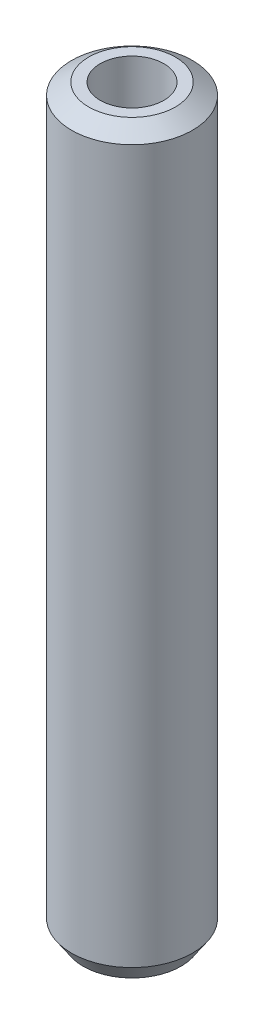
ISO-10303-21;
HEADER;
FILE_DESCRIPTION(('STEP AP214'),'2;1');
FILE_NAME('part.step','',(''),(''),'','','');
FILE_SCHEMA(('AUTOMOTIVE_DESIGN { 1 0 10303 214 1 1 1 1 }'));
ENDSEC;
DATA;
#1=APPLICATION_CONTEXT('core data for automotive mechanical design processes');
#2=APPLICATION_PROTOCOL_DEFINITION('international standard','automotive_design',2000,#1);
#3=PRODUCT_CONTEXT('',#1,'mechanical');
#4=PRODUCT('Part','Part','',(#3));
#5=PRODUCT_RELATED_PRODUCT_CATEGORY('part','',(#4));
#6=PRODUCT_DEFINITION_FORMATION('','',#4);
#7=PRODUCT_DEFINITION_CONTEXT('part definition',#1,'design');
#8=PRODUCT_DEFINITION('design','',#6,#7);
#9=PRODUCT_DEFINITION_SHAPE('','',#8);
#10=(LENGTH_UNIT() NAMED_UNIT(*) SI_UNIT(.MILLI.,.METRE.));
#11=(NAMED_UNIT(*) PLANE_ANGLE_UNIT() SI_UNIT($,.RADIAN.));
#12=(NAMED_UNIT(*) SI_UNIT($,.STERADIAN.) SOLID_ANGLE_UNIT());
#13=UNCERTAINTY_MEASURE_WITH_UNIT(LENGTH_MEASURE(1.E-05),#10,'distance_accuracy_value','');
#14=(GEOMETRIC_REPRESENTATION_CONTEXT(3) GLOBAL_UNCERTAINTY_ASSIGNED_CONTEXT((#13)) GLOBAL_UNIT_ASSIGNED_CONTEXT((#10,
#11,#12)) REPRESENTATION_CONTEXT('',''));
#15=CARTESIAN_POINT('',(0.,0.,0.));
#16=DIRECTION('',(0.,0.,1.));
#17=DIRECTION('',(1.,0.,0.));
#18=AXIS2_PLACEMENT_3D('',#15,#16,#17);
#19=CARTESIAN_POINT('',(0.,245.064112155446,0.));
#20=DIRECTION('',(0.,-1.,0.));
#21=DIRECTION('',(0.,0.,-1.));
#22=AXIS2_PLACEMENT_3D('',#19,#20,#21);
#23=CYLINDRICAL_SURFACE('',#22,20.);
#24=CARTESIAN_POINT('',(0.,241.248628773534,0.));
#25=DIRECTION('',(0.,1.,0.));
#26=DIRECTION('',(0.,0.,1.));
#27=AXIS2_PLACEMENT_3D('',#24,#25,#26);
#28=CIRCLE('',#27,20.);
#29=CARTESIAN_POINT('',(0.,241.248628773534,-20.));
#30=VERTEX_POINT('',#29);
#31=EDGE_CURVE('E50',#30,#30,#28,.F.);
#32=CARTESIAN_POINT('',(0.,5.68350444593166,0.));
#33=DIRECTION('',(0.,1.,0.));
#34=DIRECTION('',(0.,0.,1.));
#35=AXIS2_PLACEMENT_3D('',#32,#33,#34);
#36=CIRCLE('',#35,20.);
#37=CARTESIAN_POINT('',(0.,5.68350444593163,-20.));
#38=VERTEX_POINT('',#37);
#39=EDGE_CURVE('E51',#38,#38,#36,.T.);
#40=CARTESIAN_POINT('',(0.,241.248628773534,-20.));
#41=CARTESIAN_POINT('',(0.,238.794825395121,-20.));
#42=CARTESIAN_POINT('',(0.,236.341022016709,-20.));
#43=CARTESIAN_POINT('',(0.,231.433415259884,-20.));
#44=CARTESIAN_POINT('',(0.,228.979611881471,-20.));
#45=CARTESIAN_POINT('',(0.,224.072005124646,-20.));
#46=CARTESIAN_POINT('',(0.,221.618201746234,-20.));
#47=CARTESIAN_POINT('',(0.,216.710594989409,-20.));
#48=CARTESIAN_POINT('',(0.,214.256791610996,-20.));
#49=CARTESIAN_POINT('',(0.,209.349184854171,-20.));
#50=CARTESIAN_POINT('',(0.,206.895381475758,-20.));
#51=CARTESIAN_POINT('',(0.,201.987774718933,-20.));
#52=CARTESIAN_POINT('',(0.,199.533971340521,-20.));
#53=CARTESIAN_POINT('',(0.,194.626364583696,-20.));
#54=CARTESIAN_POINT('',(0.,192.172561205283,-20.));
#55=CARTESIAN_POINT('',(0.,187.264954448458,-20.));
#56=CARTESIAN_POINT('',(0.,184.811151070046,-20.));
#57=CARTESIAN_POINT('',(0.,179.903544313221,-20.));
#58=CARTESIAN_POINT('',(0.,177.449740934808,-20.));
#59=CARTESIAN_POINT('',(0.,172.542134177983,-20.));
#60=CARTESIAN_POINT('',(0.,170.088330799571,-20.));
#61=CARTESIAN_POINT('',(0.,165.180724042746,-20.));
#62=CARTESIAN_POINT('',(0.,162.726920664333,-20.));
#63=CARTESIAN_POINT('',(0.,157.819313907508,-20.));
#64=CARTESIAN_POINT('',(0.,155.365510529096,-20.));
#65=CARTESIAN_POINT('',(0.,150.45790377227,-20.));
#66=CARTESIAN_POINT('',(0.,148.004100393858,-20.));
#67=CARTESIAN_POINT('',(0.,143.096493637033,-20.));
#68=CARTESIAN_POINT('',(0.,140.64269025862,-20.));
#69=CARTESIAN_POINT('',(0.,135.735083501795,-20.));
#70=CARTESIAN_POINT('',(0.,133.281280123383,-20.));
#71=CARTESIAN_POINT('',(0.,128.373673366558,-20.));
#72=CARTESIAN_POINT('',(0.,125.919869988145,-20.));
#73=CARTESIAN_POINT('',(0.,121.01226323132,-20.));
#74=CARTESIAN_POINT('',(0.,118.558459852908,-20.));
#75=CARTESIAN_POINT('',(0.,113.650853096083,-20.));
#76=CARTESIAN_POINT('',(0.,111.19704971767,-20.));
#77=CARTESIAN_POINT('',(0.,106.289442960845,-20.));
#78=CARTESIAN_POINT('',(0.,103.835639582433,-20.));
#79=CARTESIAN_POINT('',(0.,98.9280328256075,-20.));
#80=CARTESIAN_POINT('',(0.,96.474229447195,-20.));
#81=CARTESIAN_POINT('',(0.,91.5666226903699,-20.));
#82=CARTESIAN_POINT('',(0.,89.1128193119574,-20.));
#83=CARTESIAN_POINT('',(0.,84.2052125551323,-20.));
#84=CARTESIAN_POINT('',(0.,81.7514091767198,-20.));
#85=CARTESIAN_POINT('',(0.,76.8438024198948,-20.));
#86=CARTESIAN_POINT('',(0.,74.3899990414823,-20.));
#87=CARTESIAN_POINT('',(0.,69.4823922846572,-20.));
#88=CARTESIAN_POINT('',(0.,67.0285889062447,-20.));
#89=CARTESIAN_POINT('',(0.,62.1209821494197,-20.));
#90=CARTESIAN_POINT('',(0.,59.6671787710071,-20.));
#91=CARTESIAN_POINT('',(0.,54.7595720141821,-20.));
#92=CARTESIAN_POINT('',(0.,52.3057686357695,-20.));
#93=CARTESIAN_POINT('',(0.,47.3981618789445,-20.));
#94=CARTESIAN_POINT('',(0.,44.944358500532,-20.));
#95=CARTESIAN_POINT('',(0.,40.0367517437069,-20.));
#96=CARTESIAN_POINT('',(0.,37.5829483652944,-20.));
#97=CARTESIAN_POINT('',(0.,32.6753416084694,-20.));
#98=CARTESIAN_POINT('',(0.,30.2215382300568,-20.));
#99=CARTESIAN_POINT('',(0.,25.3139314732318,-20.));
#100=CARTESIAN_POINT('',(0.,22.8601280948193,-20.));
#101=CARTESIAN_POINT('',(0.,17.9525213379942,-20.));
#102=CARTESIAN_POINT('',(0.,15.4987179595817,-20.));
#103=CARTESIAN_POINT('',(0.,10.5911112027567,-20.));
#104=CARTESIAN_POINT('',(0.,8.13730782434415,-20.));
#105=CARTESIAN_POINT('',(0.,5.68350444593163,-20.));
#106=B_SPLINE_CURVE_WITH_KNOTS('',3,(#40,#41,#42,#43,#44,#45,#46,#47,#48,#49,#50,#51,#52,#53,
#54,#55,#56,#57,#58,#59,#60,#61,#62,#63,#64,#65,#66,#67,#68,#69,#70,#71,#72,#73,#74,#75,#76,#77,
#78,#79,#80,#81,#82,#83,#84,#85,#86,#87,#88,#89,#90,#91,#92,#93,#94,#95,#96,#97,#98,#99,#100,
#101,#102,#103,#104,#105),.UNSPECIFIED.,.F.,.F.,(4,2,2,2,2,2,2,2,2,2,2,2,2,2,2,2,2,2,2,2,2,2,2,
2,2,2,2,2,2,2,2,2,4),(0.,7.36141013523758,14.7228202704751,22.0842304057127,29.4456405409503,
36.8070506761879,44.1684608114254,51.529870946663,58.8912810819005,66.2526912171381,
73.6141013523757,80.9755114876133,88.3369216228508,95.6983317580884,103.059741893326,
110.421152028564,117.782562163801,125.143972299039,132.505382434276,139.866792569514,
147.228202704751,154.589612839989,161.951022975226,169.312433110464,176.673843245702,
184.035253380939,191.396663516177,198.758073651414,206.119483786652,213.480893921889,
220.842304057127,228.203714192365,235.565124327602),.UNSPECIFIED.);
#107=EDGE_CURVE('BSEAM39',#30,#38,#106,.T.);
#108=ORIENTED_EDGE('',*,*,#31,.T.);
#109=ORIENTED_EDGE('',*,*,#39,.T.);
#110=ORIENTED_EDGE('',*,*,#107,.T.);
#111=ORIENTED_EDGE('',*,*,#107,.F.);
#112=EDGE_LOOP('',(#108,#110,#109,#111));
#113=FACE_BOUND('',#112,.T.);
#114=ADVANCED_FACE('F39',(#113),#23,.T.);
#115=CARTESIAN_POINT('',(0.,245.064112155446,0.));
#116=DIRECTION('',(0.,1.,0.));
#117=DIRECTION('',(0.,0.,1.));
#118=AXIS2_PLACEMENT_3D('',#115,#116,#117);
#119=PLANE('',#118);
#120=CARTESIAN_POINT('',(0.,245.064112155446,0.));
#121=DIRECTION('',(0.,1.,0.));
#122=DIRECTION('',(0.,0.,1.));
#123=AXIS2_PLACEMENT_3D('',#120,#121,#122);
#124=CIRCLE('',#123,14.3164955540686);
#125=CARTESIAN_POINT('',(0.,245.064112155446,14.3164955540686));
#126=VERTEX_POINT('',#125);
#127=EDGE_CURVE('E54',#126,#126,#124,.T.);
#128=ORIENTED_EDGE('',*,*,#127,.T.);
#129=EDGE_LOOP('',(#128));
#130=FACE_BOUND('',#129,.T.);
#131=CARTESIAN_POINT('',(0.,245.064112155446,0.));
#132=DIRECTION('',(0.,1.,0.));
#133=DIRECTION('',(0.,0.,1.));
#134=AXIS2_PLACEMENT_3D('',#131,#132,#133);
#135=CIRCLE('',#134,10.5239331195072);
#136=CARTESIAN_POINT('',(0.,245.064112155446,-10.5239331195072));
#137=VERTEX_POINT('',#136);
#138=EDGE_CURVE('E58',#137,#137,#135,.T.);
#139=ORIENTED_EDGE('',*,*,#138,.F.);
#140=EDGE_LOOP('',(#139));
#141=FACE_BOUND('',#140,.T.);
#142=ADVANCED_FACE('F69',(#130,#141),#119,.T.);
#143=CARTESIAN_POINT('',(0.,0.,0.));
#144=DIRECTION('',(0.,1.,0.));
#145=DIRECTION('',(0.,0.,1.));
#146=AXIS2_PLACEMENT_3D('',#143,#144,#145);
#147=PLANE('',#146);
#148=CARTESIAN_POINT('',(0.,0.,0.));
#149=DIRECTION('',(0.,1.,0.));
#150=DIRECTION('',(0.,0.,1.));
#151=AXIS2_PLACEMENT_3D('',#148,#149,#150);
#152=CIRCLE('',#151,16.1845166180876);
#153=CARTESIAN_POINT('',(0.,0.,16.1845166180876));
#154=VERTEX_POINT('',#153);
#155=EDGE_CURVE('E10',#154,#154,#152,.F.);
#156=ORIENTED_EDGE('',*,*,#155,.T.);
#157=EDGE_LOOP('',(#156));
#158=FACE_BOUND('',#157,.T.);
#159=CARTESIAN_POINT('',(0.,0.,0.));
#160=DIRECTION('',(0.,1.,0.));
#161=DIRECTION('',(0.,0.,1.));
#162=AXIS2_PLACEMENT_3D('',#159,#160,#161);
#163=CIRCLE('',#162,10.5239331195072);
#164=CARTESIAN_POINT('',(0.,0.,-10.5239331195072));
#165=VERTEX_POINT('',#164);
#166=EDGE_CURVE('E63',#165,#165,#163,.T.);
#167=ORIENTED_EDGE('',*,*,#166,.T.);
#168=EDGE_LOOP('',(#167));
#169=FACE_BOUND('',#168,.T.);
#170=ADVANCED_FACE('F75',(#158,#169),#147,.F.);
#171=CARTESIAN_POINT('',(0.,245.064112155446,0.));
#172=DIRECTION('',(0.,-1.,0.));
#173=DIRECTION('',(0.,0.,-1.));
#174=AXIS2_PLACEMENT_3D('',#171,#172,#173);
#175=CYLINDRICAL_SURFACE('',#174,10.5239331195072);
#176=CARTESIAN_POINT('',(0.,245.064112155446,-10.5239331195072));
#177=CARTESIAN_POINT('',(0.,242.51136098716,-10.5239331195072));
#178=CARTESIAN_POINT('',(0.,239.958609818874,-10.5239331195072));
#179=CARTESIAN_POINT('',(0.,234.853107482303,-10.5239331195072));
#180=CARTESIAN_POINT('',(0.,232.300356314017,-10.5239331195072));
#181=CARTESIAN_POINT('',(0.,227.194853977445,-10.5239331195072));
#182=CARTESIAN_POINT('',(0.,224.642102809159,-10.5239331195072));
#183=CARTESIAN_POINT('',(0.,219.536600472587,-10.5239331195072));
#184=CARTESIAN_POINT('',(0.,216.983849304301,-10.5239331195072));
#185=CARTESIAN_POINT('',(0.,211.878346967729,-10.5239331195072));
#186=CARTESIAN_POINT('',(0.,209.325595799444,-10.5239331195072));
#187=CARTESIAN_POINT('',(0.,204.220093462872,-10.5239331195072));
#188=CARTESIAN_POINT('',(0.,201.667342294586,-10.5239331195072));
#189=CARTESIAN_POINT('',(0.,196.561839958014,-10.5239331195072));
#190=CARTESIAN_POINT('',(0.,194.009088789728,-10.5239331195072));
#191=CARTESIAN_POINT('',(0.,188.903586453156,-10.5239331195072));
#192=CARTESIAN_POINT('',(0.,186.35083528487,-10.5239331195072));
#193=CARTESIAN_POINT('',(0.,181.245332948299,-10.5239331195072));
#194=CARTESIAN_POINT('',(0.,178.692581780013,-10.5239331195072));
#195=CARTESIAN_POINT('',(0.,173.587079443441,-10.5239331195072));
#196=CARTESIAN_POINT('',(0.,171.034328275155,-10.5239331195072));
#197=CARTESIAN_POINT('',(0.,165.928825938583,-10.5239331195072));
#198=CARTESIAN_POINT('',(0.,163.376074770297,-10.5239331195072));
#199=CARTESIAN_POINT('',(0.,158.270572433726,-10.5239331195072));
#200=CARTESIAN_POINT('',(0.,155.71782126544,-10.5239331195072));
#201=CARTESIAN_POINT('',(0.,150.612318928868,-10.5239331195072));
#202=CARTESIAN_POINT('',(0.,148.059567760582,-10.5239331195072));
#203=CARTESIAN_POINT('',(0.,142.95406542401,-10.5239331195072));
#204=CARTESIAN_POINT('',(0.,140.401314255724,-10.5239331195072));
#205=CARTESIAN_POINT('',(0.,135.295811919153,-10.5239331195072));
#206=CARTESIAN_POINT('',(0.,132.743060750867,-10.5239331195072));
#207=CARTESIAN_POINT('',(0.,127.637558414295,-10.5239331195072));
#208=CARTESIAN_POINT('',(0.,125.084807246009,-10.5239331195072));
#209=CARTESIAN_POINT('',(0.,119.979304909437,-10.5239331195072));
#210=CARTESIAN_POINT('',(0.,117.426553741151,-10.5239331195072));
#211=CARTESIAN_POINT('',(0.,112.32105140458,-10.5239331195072));
#212=CARTESIAN_POINT('',(0.,109.768300236294,-10.5239331195072));
#213=CARTESIAN_POINT('',(0.,104.662797899722,-10.5239331195072));
#214=CARTESIAN_POINT('',(0.,102.110046731436,-10.5239331195072));
#215=CARTESIAN_POINT('',(0.,97.0045443948641,-10.5239331195072));
#216=CARTESIAN_POINT('',(0.,94.4517932265782,-10.5239331195072));
#217=CARTESIAN_POINT('',(0.,89.3462908900064,-10.5239331195072));
#218=CARTESIAN_POINT('',(0.,86.7935397217205,-10.5239331195072));
#219=CARTESIAN_POINT('',(0.,81.6880373851487,-10.5239331195072));
#220=CARTESIAN_POINT('',(0.,79.1352862168628,-10.5239331195072));
#221=CARTESIAN_POINT('',(0.,74.029783880291,-10.5239331195072));
#222=CARTESIAN_POINT('',(0.,71.4770327120051,-10.5239331195072));
#223=CARTESIAN_POINT('',(0.,66.3715303754334,-10.5239331195072));
#224=CARTESIAN_POINT('',(0.,63.8187792071474,-10.5239331195072));
#225=CARTESIAN_POINT('',(0.,58.7132768705756,-10.5239331195072));
#226=CARTESIAN_POINT('',(0.,56.1605257022897,-10.5239331195072));
#227=CARTESIAN_POINT('',(0.,51.0550233657179,-10.5239331195072));
#228=CARTESIAN_POINT('',(0.,48.502272197432,-10.5239331195072));
#229=CARTESIAN_POINT('',(0.,43.3967698608603,-10.5239331195072));
#230=CARTESIAN_POINT('',(0.,40.8440186925744,-10.5239331195072));
#231=CARTESIAN_POINT('',(0.,35.7385163560026,-10.5239331195072));
#232=CARTESIAN_POINT('',(0.,33.1857651877167,-10.5239331195072));
#233=CARTESIAN_POINT('',(0.,28.0802628511449,-10.5239331195072));
#234=CARTESIAN_POINT('',(0.,25.527511682859,-10.5239331195072));
#235=CARTESIAN_POINT('',(0.,20.4220093462872,-10.5239331195072));
#236=CARTESIAN_POINT('',(0.,17.8692581780013,-10.5239331195072));
#237=CARTESIAN_POINT('',(0.,12.7637558414295,-10.5239331195072));
#238=CARTESIAN_POINT('',(0.,10.2110046731436,-10.5239331195072));
#239=CARTESIAN_POINT('',(0.,5.10550233657179,-10.5239331195072));
#240=CARTESIAN_POINT('',(0.,2.5527511682859,-10.5239331195072));
#241=CARTESIAN_POINT('',(0.,0.,-10.5239331195072));
#242=B_SPLINE_CURVE_WITH_KNOTS('',3,(#176,#177,#178,#179,#180,#181,#182,#183,#184,#185,#186,
#187,#188,#189,#190,#191,#192,#193,#194,#195,#196,#197,#198,#199,#200,#201,#202,#203,#204,#205,
#206,#207,#208,#209,#210,#211,#212,#213,#214,#215,#216,#217,#218,#219,#220,#221,#222,#223,#224,
#225,#226,#227,#228,#229,#230,#231,#232,#233,#234,#235,#236,#237,#238,#239,#240,#241),
.UNSPECIFIED.,.F.,.F.,(4,2,2,2,2,2,2,2,2,2,2,2,2,2,2,2,2,2,2,2,2,2,2,2,2,2,2,2,2,2,2,2,4),(0.,
7.65825350485771,15.3165070097154,22.9747605145731,30.6330140194308,38.2912675242885,
45.9495210291461,53.6077745340039,61.2660280388616,68.9242815437192,76.5825350485769,
84.2407885534346,91.8990420582923,99.55729556315,107.215549068008,114.873802572865,
122.532056077723,130.190309582581,137.848563087438,145.506816592296,153.165070097154,
160.823323602012,168.481577106869,176.139830611727,183.798084116585,191.456337621442,
199.1145911263,206.772844631158,214.431098136015,222.089351640873,229.747605145731,
237.405858650588,245.064112155446),.UNSPECIFIED.);
#243=EDGE_CURVE('BSEAM70',#137,#165,#242,.T.);
#244=ORIENTED_EDGE('',*,*,#138,.T.);
#245=ORIENTED_EDGE('',*,*,#166,.F.);
#246=ORIENTED_EDGE('',*,*,#243,.T.);
#247=ORIENTED_EDGE('',*,*,#243,.F.);
#248=EDGE_LOOP('',(#244,#246,#245,#247));
#249=FACE_BOUND('',#248,.T.);
#250=ADVANCED_FACE('F70',(#249),#175,.F.);
#251=CARTESIAN_POINT('',(0.,245.064112155446,0.));
#252=DIRECTION('',(0.,-1.,0.));
#253=DIRECTION('',(0.,0.,-1.));
#254=AXIS2_PLACEMENT_3D('',#251,#252,#253);
#255=CONICAL_SURFACE('',#254,14.3164955540686,0.97957507593696);
#256=ORIENTED_EDGE('',*,*,#31,.F.);
#257=EDGE_LOOP('',(#256));
#258=FACE_BOUND('',#257,.T.);
#259=ORIENTED_EDGE('',*,*,#127,.F.);
#260=EDGE_LOOP('',(#259));
#261=FACE_BOUND('',#260,.T.);
#262=ADVANCED_FACE('F81',(#258,#261),#255,.T.);
#263=CARTESIAN_POINT('',(0.,5.68350444593166,0.));
#264=DIRECTION('',(0.,1.,0.));
#265=DIRECTION('',(0.,0.,1.));
#266=AXIS2_PLACEMENT_3D('',#263,#264,#265);
#267=CONICAL_SURFACE('',#266,20.,0.591221250857932);
#268=ORIENTED_EDGE('',*,*,#155,.F.);
#269=EDGE_LOOP('',(#268));
#270=FACE_BOUND('',#269,.T.);
#271=ORIENTED_EDGE('',*,*,#39,.F.);
#272=EDGE_LOOP('',(#271));
#273=FACE_BOUND('',#272,.T.);
#274=ADVANCED_FACE('F45',(#270,#273),#267,.T.);
#275=CLOSED_SHELL('',(#114,#142,#170,#250,#262,#274));
#276=MANIFOLD_SOLID_BREP('B2',#275);
#277=ADVANCED_BREP_SHAPE_REPRESENTATION('',(#18,#276),#14);
#278=SHAPE_DEFINITION_REPRESENTATION(#9,#277);
ENDSEC;
END-ISO-10303-21;
